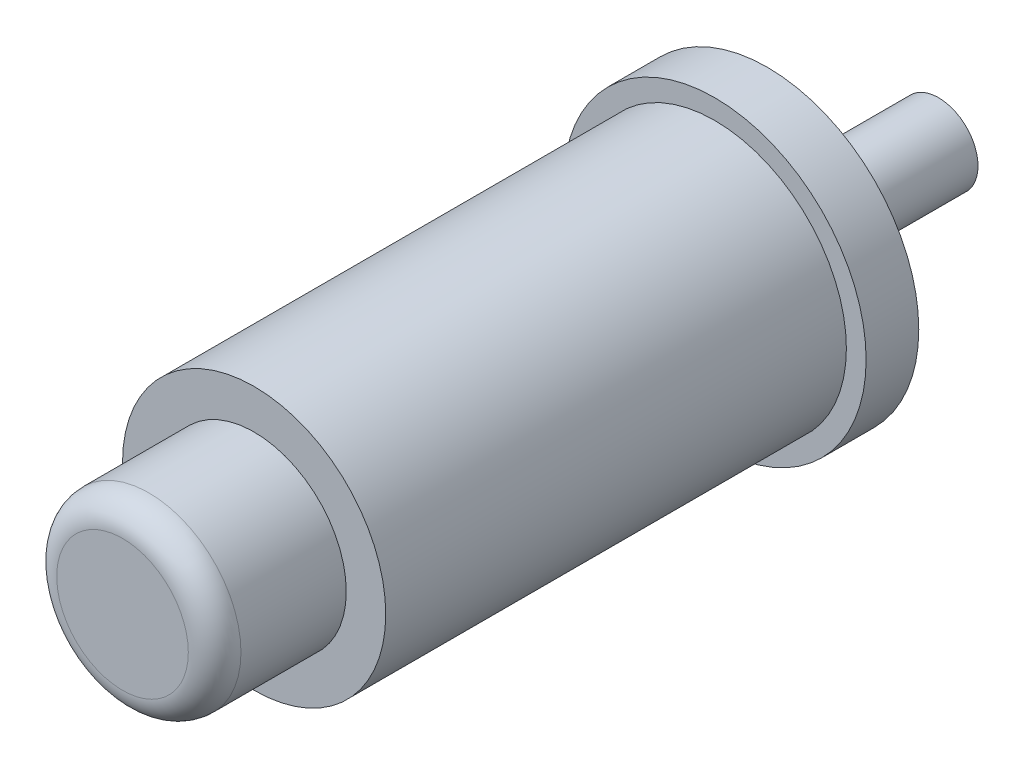
ISO-10303-21;
HEADER;
FILE_DESCRIPTION(('STEP AP214'),'2;1');
FILE_NAME('part.step','',(''),(''),'','','');
FILE_SCHEMA(('AUTOMOTIVE_DESIGN { 1 0 10303 214 1 1 1 1 }'));
ENDSEC;
DATA;
#1=APPLICATION_CONTEXT('core data for automotive mechanical design processes');
#2=APPLICATION_PROTOCOL_DEFINITION('international standard','automotive_design',2000,#1);
#3=PRODUCT_CONTEXT('',#1,'mechanical');
#4=PRODUCT('Part','Part','',(#3));
#5=PRODUCT_RELATED_PRODUCT_CATEGORY('part','',(#4));
#6=PRODUCT_DEFINITION_FORMATION('','',#4);
#7=PRODUCT_DEFINITION_CONTEXT('part definition',#1,'design');
#8=PRODUCT_DEFINITION('design','',#6,#7);
#9=PRODUCT_DEFINITION_SHAPE('','',#8);
#10=(LENGTH_UNIT() NAMED_UNIT(*) SI_UNIT(.MILLI.,.METRE.));
#11=(NAMED_UNIT(*) PLANE_ANGLE_UNIT() SI_UNIT($,.RADIAN.));
#12=(NAMED_UNIT(*) SI_UNIT($,.STERADIAN.) SOLID_ANGLE_UNIT());
#13=UNCERTAINTY_MEASURE_WITH_UNIT(LENGTH_MEASURE(1.E-05),#10,'distance_accuracy_value','');
#14=(GEOMETRIC_REPRESENTATION_CONTEXT(3) GLOBAL_UNCERTAINTY_ASSIGNED_CONTEXT((#13)) GLOBAL_UNIT_ASSIGNED_CONTEXT((#10,
#11,#12)) REPRESENTATION_CONTEXT('',''));
#15=CARTESIAN_POINT('',(0.,0.,0.));
#16=DIRECTION('',(0.,0.,1.));
#17=DIRECTION('',(1.,0.,0.));
#18=AXIS2_PLACEMENT_3D('',#15,#16,#17);
#19=CARTESIAN_POINT('',(0.,0.,-1.3));
#20=DIRECTION('',(0.,0.,1.));
#21=DIRECTION('',(1.,0.,0.));
#22=AXIS2_PLACEMENT_3D('',#19,#20,#21);
#23=CYLINDRICAL_SURFACE('',#22,0.3);
#24=CARTESIAN_POINT('',(0.,0.,-1.3));
#25=DIRECTION('',(0.,0.,1.));
#26=DIRECTION('',(1.,0.,0.));
#27=AXIS2_PLACEMENT_3D('',#24,#25,#26);
#28=CIRCLE('',#27,0.3);
#29=CARTESIAN_POINT('',(0.3,0.,-1.3));
#30=VERTEX_POINT('',#29);
#31=EDGE_CURVE('E11',#30,#30,#28,.T.);
#32=ORIENTED_EDGE('',*,*,#31,.T.);
#33=EDGE_LOOP('',(#32));
#34=FACE_BOUND('',#33,.T.);
#35=CARTESIAN_POINT('',(0.,0.,0.));
#36=DIRECTION('',(0.,0.,1.));
#37=DIRECTION('',(1.,0.,0.));
#38=AXIS2_PLACEMENT_3D('',#35,#36,#37);
#39=CIRCLE('',#38,0.3);
#40=CARTESIAN_POINT('',(0.3,0.,0.));
#41=VERTEX_POINT('',#40);
#42=EDGE_CURVE('E44',#41,#41,#39,.T.);
#43=ORIENTED_EDGE('',*,*,#42,.F.);
#44=EDGE_LOOP('',(#43));
#45=FACE_BOUND('',#44,.T.);
#46=ADVANCED_FACE('F41',(#34,#45),#23,.T.);
#47=CARTESIAN_POINT('',(0.,0.,-1.3));
#48=DIRECTION('',(0.,0.,1.));
#49=DIRECTION('',(1.,0.,0.));
#50=AXIS2_PLACEMENT_3D('',#47,#48,#49);
#51=PLANE('',#50);
#52=ORIENTED_EDGE('',*,*,#31,.F.);
#53=EDGE_LOOP('',(#52));
#54=FACE_BOUND('',#53,.T.);
#55=ADVANCED_FACE('F56',(#54),#51,.F.);
#56=CARTESIAN_POINT('',(0.,0.,0.));
#57=DIRECTION('',(0.,0.,1.));
#58=DIRECTION('',(1.,0.,0.));
#59=AXIS2_PLACEMENT_3D('',#56,#57,#58);
#60=PLANE('',#59);
#61=ORIENTED_EDGE('',*,*,#42,.T.);
#62=EDGE_LOOP('',(#61));
#63=FACE_BOUND('',#62,.T.);
#64=ADVANCED_FACE('F53',(#63),#60,.T.);
#65=CLOSED_SHELL('',(#46,#55,#64));
#66=MANIFOLD_SOLID_BREP('B2',#65);
#67=CARTESIAN_POINT('',(0.,0.,3.9));
#68=DIRECTION('',(0.,0.,-1.));
#69=DIRECTION('',(-1.,0.,0.));
#70=AXIS2_PLACEMENT_3D('',#67,#68,#69);
#71=CYLINDRICAL_SURFACE('',#70,1.);
#72=CARTESIAN_POINT('',(0.,0.,0.4));
#73=DIRECTION('',(0.,0.,1.));
#74=DIRECTION('',(1.,0.,0.));
#75=AXIS2_PLACEMENT_3D('',#72,#73,#74);
#76=CIRCLE('',#75,1.);
#77=CARTESIAN_POINT('',(1.,0.,0.4));
#78=VERTEX_POINT('',#77);
#79=EDGE_CURVE('E103',#78,#78,#76,.T.);
#80=ORIENTED_EDGE('',*,*,#79,.T.);
#81=EDGE_LOOP('',(#80));
#82=FACE_BOUND('',#81,.T.);
#83=CARTESIAN_POINT('',(0.,0.,3.9));
#84=DIRECTION('',(0.,0.,1.));
#85=DIRECTION('',(1.,0.,0.));
#86=AXIS2_PLACEMENT_3D('',#83,#84,#85);
#87=CIRCLE('',#86,1.);
#88=CARTESIAN_POINT('',(1.,0.,3.9));
#89=VERTEX_POINT('',#88);
#90=EDGE_CURVE('E93',#89,#89,#87,.T.);
#91=ORIENTED_EDGE('',*,*,#90,.F.);
#92=EDGE_LOOP('',(#91));
#93=FACE_BOUND('',#92,.T.);
#94=ADVANCED_FACE('F82',(#82,#93),#71,.T.);
#95=CARTESIAN_POINT('',(0.,0.,3.9));
#96=DIRECTION('',(0.,0.,1.));
#97=DIRECTION('',(1.,0.,0.));
#98=AXIS2_PLACEMENT_3D('',#95,#96,#97);
#99=PLANE('',#98);
#100=CARTESIAN_POINT('',(0.,0.,3.9));
#101=DIRECTION('',(0.,0.,1.));
#102=DIRECTION('',(1.,0.,0.));
#103=AXIS2_PLACEMENT_3D('',#100,#101,#102);
#104=CIRCLE('',#103,0.7);
#105=CARTESIAN_POINT('',(0.7,0.,3.9));
#106=VERTEX_POINT('',#105);
#107=EDGE_CURVE('E104',#106,#106,#104,.T.);
#108=ORIENTED_EDGE('',*,*,#107,.F.);
#109=EDGE_LOOP('',(#108));
#110=FACE_BOUND('',#109,.T.);
#111=ORIENTED_EDGE('',*,*,#90,.T.);
#112=EDGE_LOOP('',(#111));
#113=FACE_BOUND('',#112,.T.);
#114=ADVANCED_FACE('F114',(#110,#113),#99,.T.);
#115=CARTESIAN_POINT('',(0.,0.,0.4));
#116=DIRECTION('',(0.,0.,-1.));
#117=DIRECTION('',(-1.,0.,0.));
#118=AXIS2_PLACEMENT_3D('',#115,#116,#117);
#119=CYLINDRICAL_SURFACE('',#118,1.15);
#120=CARTESIAN_POINT('',(0.,0.,0.4));
#121=DIRECTION('',(0.,0.,1.));
#122=DIRECTION('',(1.,0.,0.));
#123=AXIS2_PLACEMENT_3D('',#120,#121,#122);
#124=CIRCLE('',#123,1.15);
#125=CARTESIAN_POINT('',(1.15,0.,0.4));
#126=VERTEX_POINT('',#125);
#127=EDGE_CURVE('E97',#126,#126,#124,.T.);
#128=ORIENTED_EDGE('',*,*,#127,.F.);
#129=EDGE_LOOP('',(#128));
#130=FACE_BOUND('',#129,.T.);
#131=CARTESIAN_POINT('',(0.,0.,0.));
#132=DIRECTION('',(0.,0.,1.));
#133=DIRECTION('',(1.,0.,0.));
#134=AXIS2_PLACEMENT_3D('',#131,#132,#133);
#135=CIRCLE('',#134,1.15);
#136=CARTESIAN_POINT('',(1.15,0.,0.));
#137=VERTEX_POINT('',#136);
#138=EDGE_CURVE('E100',#137,#137,#135,.T.);
#139=ORIENTED_EDGE('',*,*,#138,.T.);
#140=EDGE_LOOP('',(#139));
#141=FACE_BOUND('',#140,.T.);
#142=ADVANCED_FACE('F117',(#130,#141),#119,.T.);
#143=CARTESIAN_POINT('',(0.,0.,0.4));
#144=DIRECTION('',(0.,0.,1.));
#145=DIRECTION('',(1.,0.,0.));
#146=AXIS2_PLACEMENT_3D('',#143,#144,#145);
#147=PLANE('',#146);
#148=ORIENTED_EDGE('',*,*,#79,.F.);
#149=EDGE_LOOP('',(#148));
#150=FACE_BOUND('',#149,.T.);
#151=ORIENTED_EDGE('',*,*,#127,.T.);
#152=EDGE_LOOP('',(#151));
#153=FACE_BOUND('',#152,.T.);
#154=ADVANCED_FACE('F128',(#150,#153),#147,.T.);
#155=CARTESIAN_POINT('',(0.,0.,0.));
#156=DIRECTION('',(0.,0.,1.));
#157=DIRECTION('',(1.,0.,0.));
#158=AXIS2_PLACEMENT_3D('',#155,#156,#157);
#159=PLANE('',#158);
#160=ORIENTED_EDGE('',*,*,#138,.F.);
#161=EDGE_LOOP('',(#160));
#162=FACE_BOUND('',#161,.T.);
#163=ADVANCED_FACE('F126',(#162),#159,.F.);
#164=CARTESIAN_POINT('',(0.,0.,4.9));
#165=DIRECTION('',(0.,0.,-1.));
#166=DIRECTION('',(-1.,0.,0.));
#167=AXIS2_PLACEMENT_3D('',#164,#165,#166);
#168=CYLINDRICAL_SURFACE('',#167,0.7);
#169=CARTESIAN_POINT('',(0.,0.,4.7));
#170=DIRECTION('',(0.,0.,1.));
#171=DIRECTION('',(1.,0.,0.));
#172=AXIS2_PLACEMENT_3D('',#169,#170,#171);
#173=CIRCLE('',#172,0.7);
#174=CARTESIAN_POINT('',(0.7,0.,4.7));
#175=VERTEX_POINT('',#174);
#176=EDGE_CURVE('E40',#175,#175,#173,.F.);
#177=ORIENTED_EDGE('',*,*,#176,.T.);
#178=EDGE_LOOP('',(#177));
#179=FACE_BOUND('',#178,.T.);
#180=ORIENTED_EDGE('',*,*,#107,.T.);
#181=EDGE_LOOP('',(#180));
#182=FACE_BOUND('',#181,.T.);
#183=ADVANCED_FACE('F112',(#179,#182),#168,.T.);
#184=CARTESIAN_POINT('',(0.,0.,4.9));
#185=DIRECTION('',(0.,0.,1.));
#186=DIRECTION('',(1.,0.,0.));
#187=AXIS2_PLACEMENT_3D('',#184,#185,#186);
#188=PLANE('',#187);
#189=CARTESIAN_POINT('',(0.,0.,4.9));
#190=DIRECTION('',(0.,0.,1.));
#191=DIRECTION('',(1.,0.,0.));
#192=AXIS2_PLACEMENT_3D('',#189,#190,#191);
#193=CIRCLE('',#192,0.5);
#194=CARTESIAN_POINT('',(0.5,0.,4.9));
#195=VERTEX_POINT('',#194);
#196=EDGE_CURVE('E89',#195,#195,#193,.T.);
#197=ORIENTED_EDGE('',*,*,#196,.T.);
#198=EDGE_LOOP('',(#197));
#199=FACE_BOUND('',#198,.T.);
#200=ADVANCED_FACE('F139',(#199),#188,.T.);
#201=CARTESIAN_POINT('',(0.,0.,4.7));
#202=DIRECTION('',(0.,0.,1.));
#203=DIRECTION('',(1.,0.,0.));
#204=AXIS2_PLACEMENT_3D('',#201,#202,#203);
#205=TOROIDAL_SURFACE('',#204,0.5,0.2);
#206=ORIENTED_EDGE('',*,*,#176,.F.);
#207=EDGE_LOOP('',(#206));
#208=FACE_BOUND('',#207,.T.);
#209=ORIENTED_EDGE('',*,*,#196,.F.);
#210=EDGE_LOOP('',(#209));
#211=FACE_BOUND('',#210,.T.);
#212=ADVANCED_FACE('F84',(#208,#211),#205,.T.);
#213=CLOSED_SHELL('',(#94,#114,#142,#154,#163,#183,#200,#212));
#214=MANIFOLD_SOLID_BREP('B6',#213);
#215=ADVANCED_BREP_SHAPE_REPRESENTATION('',(#18,#66,#214),#14);
#216=SHAPE_DEFINITION_REPRESENTATION(#9,#215);
ENDSEC;
END-ISO-10303-21;
